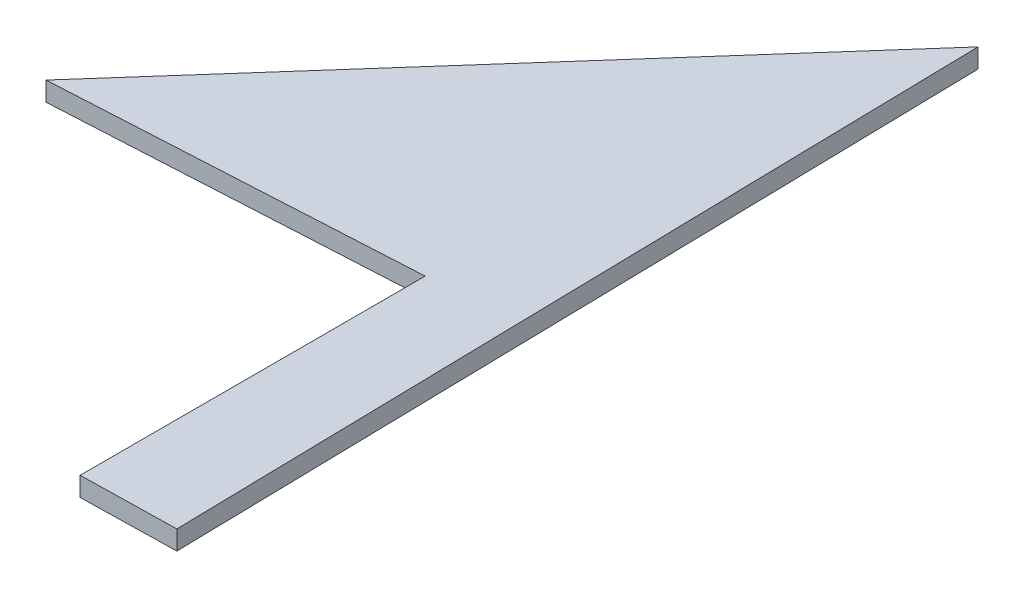
ISO-10303-21;
HEADER;
FILE_DESCRIPTION(('STEP AP214'),'2;1');
FILE_NAME('part.step','',(''),(''),'','','');
FILE_SCHEMA(('AUTOMOTIVE_DESIGN { 1 0 10303 214 1 1 1 1 }'));
ENDSEC;
DATA;
#1=APPLICATION_CONTEXT('core data for automotive mechanical design processes');
#2=APPLICATION_PROTOCOL_DEFINITION('international standard','automotive_design',2000,#1);
#3=PRODUCT_CONTEXT('',#1,'mechanical');
#4=PRODUCT('Part','Part','',(#3));
#5=PRODUCT_RELATED_PRODUCT_CATEGORY('part','',(#4));
#6=PRODUCT_DEFINITION_FORMATION('','',#4);
#7=PRODUCT_DEFINITION_CONTEXT('part definition',#1,'design');
#8=PRODUCT_DEFINITION('design','',#6,#7);
#9=PRODUCT_DEFINITION_SHAPE('','',#8);
#10=(LENGTH_UNIT() NAMED_UNIT(*) SI_UNIT(.MILLI.,.METRE.));
#11=(NAMED_UNIT(*) PLANE_ANGLE_UNIT() SI_UNIT($,.RADIAN.));
#12=(NAMED_UNIT(*) SI_UNIT($,.STERADIAN.) SOLID_ANGLE_UNIT());
#13=UNCERTAINTY_MEASURE_WITH_UNIT(LENGTH_MEASURE(1.E-05),#10,'distance_accuracy_value','');
#14=(GEOMETRIC_REPRESENTATION_CONTEXT(3) GLOBAL_UNCERTAINTY_ASSIGNED_CONTEXT((#13)) GLOBAL_UNIT_ASSIGNED_CONTEXT((#10,
#11,#12)) REPRESENTATION_CONTEXT('',''));
#15=CARTESIAN_POINT('',(0.,0.,0.));
#16=DIRECTION('',(0.,0.,1.));
#17=DIRECTION('',(1.,0.,0.));
#18=AXIS2_PLACEMENT_3D('',#15,#16,#17);
#19=CARTESIAN_POINT('',(0.,2.,0.));
#20=DIRECTION('',(-0.0549489895579575,0.,-0.998489162958997));
#21=DIRECTION('',(-0.998489162958998,0.,0.0549489895579575));
#22=AXIS2_PLACEMENT_3D('',#19,#20,#21);
#23=PLANE('',#22);
#24=DIRECTION('',(0.998489162958997,0.,-0.0549489895579575));
#25=VECTOR('',#24,1.);
#26=CARTESIAN_POINT('',(0.,0.,0.));
#27=LINE('',#26,#25);
#28=CARTESIAN_POINT('',(0.,0.,0.));
#29=VERTEX_POINT('',#28);
#30=CARTESIAN_POINT('',(37.3825671548758,0.,-2.05724245033921));
#31=VERTEX_POINT('',#30);
#32=EDGE_CURVE('E118',#29,#31,#27,.T.);
#33=ORIENTED_EDGE('',*,*,#32,.T.);
#34=DIRECTION('',(0.,-1.,0.));
#35=VECTOR('',#34,1.);
#36=CARTESIAN_POINT('',(37.3825671548758,2.,-2.05724245033921));
#37=LINE('',#36,#35);
#38=CARTESIAN_POINT('',(37.3825671548758,2.,-2.05724245033921));
#39=VERTEX_POINT('',#38);
#40=EDGE_CURVE('E11',#39,#31,#37,.T.);
#41=ORIENTED_EDGE('',*,*,#40,.F.);
#42=DIRECTION('',(0.998489162958997,0.,-0.0549489895579575));
#43=VECTOR('',#42,1.);
#44=CARTESIAN_POINT('',(0.,2.,0.));
#45=LINE('',#44,#43);
#46=CARTESIAN_POINT('',(0.,2.,0.));
#47=VERTEX_POINT('',#46);
#48=EDGE_CURVE('E131',#47,#39,#45,.T.);
#49=ORIENTED_EDGE('',*,*,#48,.F.);
#50=DIRECTION('',(0.,-1.,0.));
#51=VECTOR('',#50,1.);
#52=CARTESIAN_POINT('',(0.,2.,0.));
#53=LINE('',#52,#51);
#54=EDGE_CURVE('E114',#47,#29,#53,.T.);
#55=ORIENTED_EDGE('',*,*,#54,.T.);
#56=EDGE_LOOP('',(#33,#41,#49,#55));
#57=FACE_BOUND('',#56,.T.);
#58=ADVANCED_FACE('F39',(#57),#23,.F.);
#59=CARTESIAN_POINT('',(37.3825671548758,2.,-2.05724245033921));
#60=DIRECTION('',(1.,0.,0.));
#61=DIRECTION('',(0.,0.,-1.));
#62=AXIS2_PLACEMENT_3D('',#59,#60,#61);
#63=PLANE('',#62);
#64=DIRECTION('',(0.,0.,1.));
#65=VECTOR('',#64,1.);
#66=CARTESIAN_POINT('',(37.3825671548758,0.,-2.05724245033921));
#67=LINE('',#66,#65);
#68=CARTESIAN_POINT('',(37.3825671548758,0.,33.8342772377264));
#69=VERTEX_POINT('',#68);
#70=EDGE_CURVE('E122',#31,#69,#67,.T.);
#71=ORIENTED_EDGE('',*,*,#70,.T.);
#72=DIRECTION('',(0.,-1.,0.));
#73=VECTOR('',#72,1.);
#74=CARTESIAN_POINT('',(37.3825671548758,2.,33.8342772377264));
#75=LINE('',#74,#73);
#76=CARTESIAN_POINT('',(37.3825671548758,2.,33.8342772377264));
#77=VERTEX_POINT('',#76);
#78=EDGE_CURVE('E48',#77,#69,#75,.T.);
#79=ORIENTED_EDGE('',*,*,#78,.F.);
#80=DIRECTION('',(0.,0.,1.));
#81=VECTOR('',#80,1.);
#82=CARTESIAN_POINT('',(37.3825671548758,2.,-2.05724245033921));
#83=LINE('',#82,#81);
#84=EDGE_CURVE('E90',#39,#77,#83,.T.);
#85=ORIENTED_EDGE('',*,*,#84,.F.);
#86=ORIENTED_EDGE('',*,*,#40,.T.);
#87=EDGE_LOOP('',(#71,#79,#85,#86));
#88=FACE_BOUND('',#87,.T.);
#89=ADVANCED_FACE('F153',(#88),#63,.F.);
#90=CARTESIAN_POINT('',(37.3825671548758,2.,33.8342772377264));
#91=DIRECTION('',(-0.0206073855707476,0.,-0.999787645282706));
#92=DIRECTION('',(-0.999787645282706,0.,0.0206073855707476));
#93=AXIS2_PLACEMENT_3D('',#90,#91,#92);
#94=PLANE('',#93);
#95=DIRECTION('',(0.999787645282706,0.,-0.0206073855707476));
#96=VECTOR('',#95,1.);
#97=CARTESIAN_POINT('',(37.3825671548758,0.,33.8342772377264));
#98=LINE('',#97,#96);
#99=CARTESIAN_POINT('',(47.2457467253592,0.,33.6309797221775));
#100=VERTEX_POINT('',#99);
#101=EDGE_CURVE('E106',#69,#100,#98,.T.);
#102=ORIENTED_EDGE('',*,*,#101,.T.);
#103=DIRECTION('',(0.,-1.,0.));
#104=VECTOR('',#103,1.);
#105=CARTESIAN_POINT('',(47.2457467253592,2.,33.6309797221775));
#106=LINE('',#105,#104);
#107=CARTESIAN_POINT('',(47.2457467253592,2.,33.6309797221775));
#108=VERTEX_POINT('',#107);
#109=EDGE_CURVE('E103',#108,#100,#106,.T.);
#110=ORIENTED_EDGE('',*,*,#109,.F.);
#111=DIRECTION('',(0.999787645282706,0.,-0.0206073855707476));
#112=VECTOR('',#111,1.);
#113=CARTESIAN_POINT('',(37.3825671548758,2.,33.8342772377264));
#114=LINE('',#113,#112);
#115=EDGE_CURVE('E94',#77,#108,#114,.T.);
#116=ORIENTED_EDGE('',*,*,#115,.F.);
#117=ORIENTED_EDGE('',*,*,#78,.T.);
#118=EDGE_LOOP('',(#102,#110,#116,#117));
#119=FACE_BOUND('',#118,.T.);
#120=ADVANCED_FACE('F104',(#119),#94,.F.);
#121=CARTESIAN_POINT('',(47.2457467253592,2.,33.6309797221775));
#122=DIRECTION('',(-0.999787645282706,0.,0.0206073855707545));
#123=DIRECTION('',(0.0206073855707545,0.,0.999787645282706));
#124=AXIS2_PLACEMENT_3D('',#121,#122,#123);
#125=PLANE('',#124);
#126=DIRECTION('',(-0.0206073855707545,0.,-0.999787645282706));
#127=VECTOR('',#126,1.);
#128=CARTESIAN_POINT('',(47.2457467253592,0.,33.6309797221775));
#129=LINE('',#128,#127);
#130=CARTESIAN_POINT('',(45.4917295701632,0.,-51.4668933368692));
#131=VERTEX_POINT('',#130);
#132=EDGE_CURVE('E76',#100,#131,#129,.T.);
#133=ORIENTED_EDGE('',*,*,#132,.T.);
#134=DIRECTION('',(0.,-1.,0.));
#135=VECTOR('',#134,1.);
#136=CARTESIAN_POINT('',(45.4917295701632,2.,-51.4668933368692));
#137=LINE('',#136,#135);
#138=CARTESIAN_POINT('',(45.4917295701632,2.,-51.4668933368692));
#139=VERTEX_POINT('',#138);
#140=EDGE_CURVE('E108',#139,#131,#137,.T.);
#141=ORIENTED_EDGE('',*,*,#140,.F.);
#142=DIRECTION('',(-0.0206073855707545,0.,-0.999787645282706));
#143=VECTOR('',#142,1.);
#144=CARTESIAN_POINT('',(47.2457467253592,2.,33.6309797221775));
#145=LINE('',#144,#143);
#146=EDGE_CURVE('E98',#108,#139,#145,.T.);
#147=ORIENTED_EDGE('',*,*,#146,.F.);
#148=ORIENTED_EDGE('',*,*,#109,.T.);
#149=EDGE_LOOP('',(#133,#141,#147,#148));
#150=FACE_BOUND('',#149,.T.);
#151=ADVANCED_FACE('F110',(#150),#125,.F.);
#152=CARTESIAN_POINT('',(45.4917295701632,2.,-51.4668933368692));
#153=DIRECTION('',(0.749261476086554,0.,0.662274293969348));
#154=DIRECTION('',(0.662274293969348,0.,-0.749261476086554));
#155=AXIS2_PLACEMENT_3D('',#152,#153,#154);
#156=PLANE('',#155);
#157=DIRECTION('',(-0.662274293969348,0.,0.749261476086554));
#158=VECTOR('',#157,1.);
#159=CARTESIAN_POINT('',(45.4917295701632,0.,-51.4668933368692));
#160=LINE('',#159,#158);
#161=EDGE_CURVE('E82',#131,#29,#160,.T.);
#162=ORIENTED_EDGE('',*,*,#161,.T.);
#163=ORIENTED_EDGE('',*,*,#54,.F.);
#164=DIRECTION('',(-0.662274293969348,0.,0.749261476086554));
#165=VECTOR('',#164,1.);
#166=CARTESIAN_POINT('',(45.4917295701632,2.,-51.4668933368692));
#167=LINE('',#166,#165);
#168=EDGE_CURVE('E56',#139,#47,#167,.T.);
#169=ORIENTED_EDGE('',*,*,#168,.F.);
#170=ORIENTED_EDGE('',*,*,#140,.T.);
#171=EDGE_LOOP('',(#162,#163,#169,#170));
#172=FACE_BOUND('',#171,.T.);
#173=ADVANCED_FACE('F142',(#172),#156,.F.);
#174=CARTESIAN_POINT('',(0.,2.,0.));
#175=DIRECTION('',(0.,1.,0.));
#176=DIRECTION('',(0.,0.,1.));
#177=AXIS2_PLACEMENT_3D('',#174,#175,#176);
#178=PLANE('',#177);
#179=ORIENTED_EDGE('',*,*,#48,.T.);
#180=ORIENTED_EDGE('',*,*,#84,.T.);
#181=ORIENTED_EDGE('',*,*,#115,.T.);
#182=ORIENTED_EDGE('',*,*,#146,.T.);
#183=ORIENTED_EDGE('',*,*,#168,.T.);
#184=EDGE_LOOP('',(#179,#180,#181,#182,#183));
#185=FACE_BOUND('',#184,.T.);
#186=ADVANCED_FACE('F96',(#185),#178,.T.);
#187=CARTESIAN_POINT('',(0.,0.,0.));
#188=DIRECTION('',(0.,1.,0.));
#189=DIRECTION('',(0.,0.,1.));
#190=AXIS2_PLACEMENT_3D('',#187,#188,#189);
#191=PLANE('',#190);
#192=ORIENTED_EDGE('',*,*,#32,.F.);
#193=ORIENTED_EDGE('',*,*,#161,.F.);
#194=ORIENTED_EDGE('',*,*,#132,.F.);
#195=ORIENTED_EDGE('',*,*,#101,.F.);
#196=ORIENTED_EDGE('',*,*,#70,.F.);
#197=EDGE_LOOP('',(#192,#193,#194,#195,#196));
#198=FACE_BOUND('',#197,.T.);
#199=ADVANCED_FACE('F138',(#198),#191,.F.);
#200=CLOSED_SHELL('',(#58,#89,#120,#151,#173,#186,#199));
#201=MANIFOLD_SOLID_BREP('B2',#200);
#202=ADVANCED_BREP_SHAPE_REPRESENTATION('',(#18,#201),#14);
#203=SHAPE_DEFINITION_REPRESENTATION(#9,#202);
ENDSEC;
END-ISO-10303-21;
